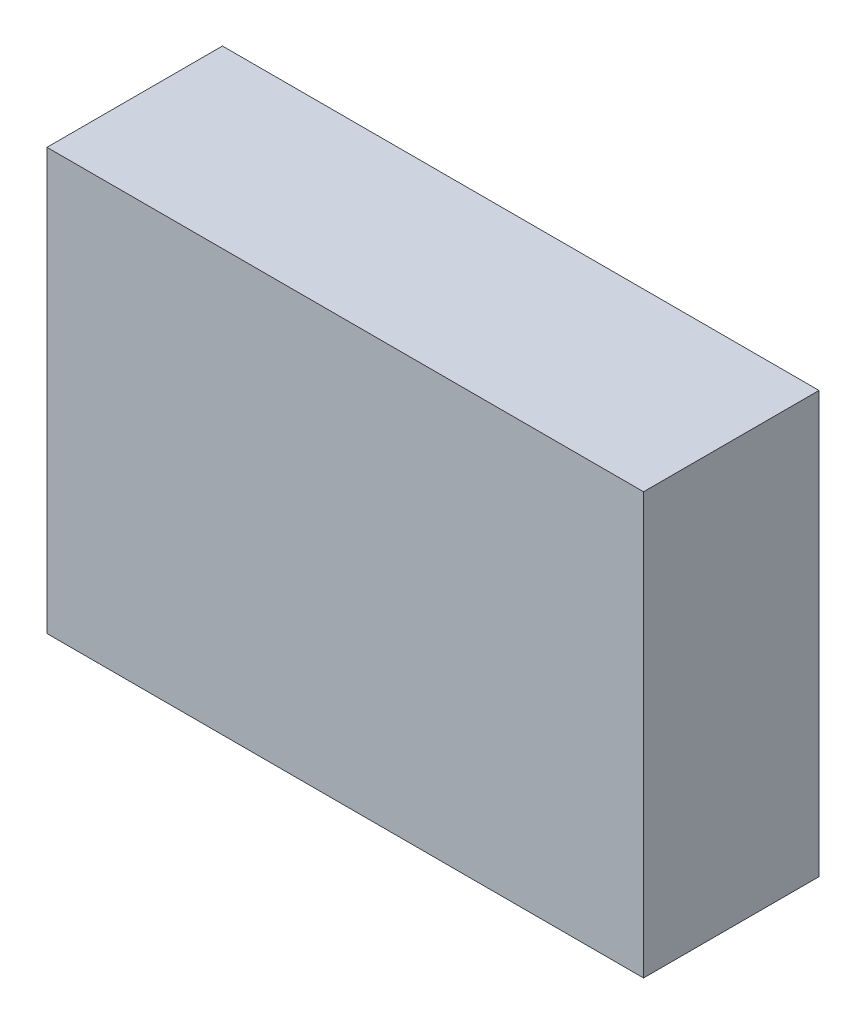
ISO-10303-21;
HEADER;
FILE_DESCRIPTION(('STEP AP214'),'2;1');
FILE_NAME('part.step','',(''),(''),'','','');
FILE_SCHEMA(('AUTOMOTIVE_DESIGN { 1 0 10303 214 1 1 1 1 }'));
ENDSEC;
DATA;
#1=APPLICATION_CONTEXT('core data for automotive mechanical design processes');
#2=APPLICATION_PROTOCOL_DEFINITION('international standard','automotive_design',2000,#1);
#3=PRODUCT_CONTEXT('',#1,'mechanical');
#4=PRODUCT('Part','Part','',(#3));
#5=PRODUCT_RELATED_PRODUCT_CATEGORY('part','',(#4));
#6=PRODUCT_DEFINITION_FORMATION('','',#4);
#7=PRODUCT_DEFINITION_CONTEXT('part definition',#1,'design');
#8=PRODUCT_DEFINITION('design','',#6,#7);
#9=PRODUCT_DEFINITION_SHAPE('','',#8);
#10=(LENGTH_UNIT() NAMED_UNIT(*) SI_UNIT(.MILLI.,.METRE.));
#11=(NAMED_UNIT(*) PLANE_ANGLE_UNIT() SI_UNIT($,.RADIAN.));
#12=(NAMED_UNIT(*) SI_UNIT($,.STERADIAN.) SOLID_ANGLE_UNIT());
#13=UNCERTAINTY_MEASURE_WITH_UNIT(LENGTH_MEASURE(1.E-05),#10,'distance_accuracy_value','');
#14=(GEOMETRIC_REPRESENTATION_CONTEXT(3) GLOBAL_UNCERTAINTY_ASSIGNED_CONTEXT((#13)) GLOBAL_UNIT_ASSIGNED_CONTEXT((#10,
#11,#12)) REPRESENTATION_CONTEXT('',''));
#15=CARTESIAN_POINT('',(0.,0.,0.));
#16=DIRECTION('',(0.,0.,1.));
#17=DIRECTION('',(1.,0.,0.));
#18=AXIS2_PLACEMENT_3D('',#15,#16,#17);
#19=CARTESIAN_POINT('',(2.58,-1.37,0.));
#20=DIRECTION('',(1.,0.,0.));
#21=DIRECTION('',(0.,0.,1.));
#22=AXIS2_PLACEMENT_3D('',#19,#20,#21);
#23=PLANE('',#22);
#24=DIRECTION('',(0.,1.,0.));
#25=VECTOR('',#24,1.);
#26=CARTESIAN_POINT('',(2.58,-1.37,0.1));
#27=LINE('',#26,#25);
#28=CARTESIAN_POINT('',(2.58,-1.37,0.1));
#29=VERTEX_POINT('',#28);
#30=CARTESIAN_POINT('',(2.58,-1.13,0.1));
#31=VERTEX_POINT('',#30);
#32=EDGE_CURVE('E11',#29,#31,#27,.T.);
#33=ORIENTED_EDGE('',*,*,#32,.T.);
#34=DIRECTION('',(0.,0.,1.));
#35=VECTOR('',#34,1.);
#36=CARTESIAN_POINT('',(2.58,-1.13,0.));
#37=LINE('',#36,#35);
#38=CARTESIAN_POINT('',(2.58,-1.13,0.));
#39=VERTEX_POINT('',#38);
#40=EDGE_CURVE('E24',#39,#31,#37,.T.);
#41=ORIENTED_EDGE('',*,*,#40,.F.);
#42=DIRECTION('',(0.,1.,0.));
#43=VECTOR('',#42,1.);
#44=CARTESIAN_POINT('',(2.58,-1.37,0.));
#45=LINE('',#44,#43);
#46=CARTESIAN_POINT('',(2.58,-1.37,0.));
#47=VERTEX_POINT('',#46);
#48=EDGE_CURVE('E86',#47,#39,#45,.T.);
#49=ORIENTED_EDGE('',*,*,#48,.F.);
#50=DIRECTION('',(0.,0.,1.));
#51=VECTOR('',#50,1.);
#52=CARTESIAN_POINT('',(2.58,-1.37,0.));
#53=LINE('',#52,#51);
#54=EDGE_CURVE('E36',#47,#29,#53,.T.);
#55=ORIENTED_EDGE('',*,*,#54,.T.);
#56=EDGE_LOOP('',(#33,#41,#49,#55));
#57=FACE_BOUND('',#56,.T.);
#58=ADVANCED_FACE('F17',(#57),#23,.F.);
#59=CARTESIAN_POINT('',(2.92,-1.37,0.));
#60=DIRECTION('',(1.,0.,0.));
#61=DIRECTION('',(0.,0.,1.));
#62=AXIS2_PLACEMENT_3D('',#59,#60,#61);
#63=PLANE('',#62);
#64=DIRECTION('',(0.,0.,1.));
#65=VECTOR('',#64,1.);
#66=CARTESIAN_POINT('',(2.92,-1.37,0.));
#67=LINE('',#66,#65);
#68=CARTESIAN_POINT('',(2.92,-1.37,0.));
#69=VERTEX_POINT('',#68);
#70=CARTESIAN_POINT('',(2.92,-1.37,0.1));
#71=VERTEX_POINT('',#70);
#72=EDGE_CURVE('E83',#69,#71,#67,.T.);
#73=ORIENTED_EDGE('',*,*,#72,.F.);
#74=DIRECTION('',(0.,1.,0.));
#75=VECTOR('',#74,1.);
#76=CARTESIAN_POINT('',(2.92,-1.37,0.));
#77=LINE('',#76,#75);
#78=CARTESIAN_POINT('',(2.92,-1.13,0.));
#79=VERTEX_POINT('',#78);
#80=EDGE_CURVE('E63',#69,#79,#77,.T.);
#81=ORIENTED_EDGE('',*,*,#80,.T.);
#82=DIRECTION('',(0.,0.,1.));
#83=VECTOR('',#82,1.);
#84=CARTESIAN_POINT('',(2.92,-1.13,0.));
#85=LINE('',#84,#83);
#86=CARTESIAN_POINT('',(2.92,-1.13,0.1));
#87=VERTEX_POINT('',#86);
#88=EDGE_CURVE('E57',#79,#87,#85,.T.);
#89=ORIENTED_EDGE('',*,*,#88,.T.);
#90=DIRECTION('',(0.,1.,0.));
#91=VECTOR('',#90,1.);
#92=CARTESIAN_POINT('',(2.92,-1.37,0.1));
#93=LINE('',#92,#91);
#94=EDGE_CURVE('E60',#71,#87,#93,.T.);
#95=ORIENTED_EDGE('',*,*,#94,.F.);
#96=EDGE_LOOP('',(#73,#81,#89,#95));
#97=FACE_BOUND('',#96,.T.);
#98=ADVANCED_FACE('F59',(#97),#63,.T.);
#99=CARTESIAN_POINT('',(2.58,-1.37,0.));
#100=DIRECTION('',(0.,1.,0.));
#101=DIRECTION('',(0.,0.,1.));
#102=AXIS2_PLACEMENT_3D('',#99,#100,#101);
#103=PLANE('',#102);
#104=ORIENTED_EDGE('',*,*,#72,.T.);
#105=DIRECTION('',(1.,0.,0.));
#106=VECTOR('',#105,1.);
#107=CARTESIAN_POINT('',(2.58,-1.37,0.1));
#108=LINE('',#107,#106);
#109=EDGE_CURVE('E71',#29,#71,#108,.T.);
#110=ORIENTED_EDGE('',*,*,#109,.F.);
#111=ORIENTED_EDGE('',*,*,#54,.F.);
#112=DIRECTION('',(1.,0.,0.));
#113=VECTOR('',#112,1.);
#114=CARTESIAN_POINT('',(2.58,-1.37,0.));
#115=LINE('',#114,#113);
#116=EDGE_CURVE('E76',#47,#69,#115,.T.);
#117=ORIENTED_EDGE('',*,*,#116,.T.);
#118=EDGE_LOOP('',(#104,#110,#111,#117));
#119=FACE_BOUND('',#118,.T.);
#120=ADVANCED_FACE('F91',(#119),#103,.F.);
#121=CARTESIAN_POINT('',(2.58,-1.13,0.));
#122=DIRECTION('',(0.,1.,0.));
#123=DIRECTION('',(0.,0.,1.));
#124=AXIS2_PLACEMENT_3D('',#121,#122,#123);
#125=PLANE('',#124);
#126=DIRECTION('',(1.,0.,0.));
#127=VECTOR('',#126,1.);
#128=CARTESIAN_POINT('',(2.58,-1.13,0.));
#129=LINE('',#128,#127);
#130=EDGE_CURVE('E74',#39,#79,#129,.T.);
#131=ORIENTED_EDGE('',*,*,#130,.F.);
#132=ORIENTED_EDGE('',*,*,#40,.T.);
#133=DIRECTION('',(1.,0.,0.));
#134=VECTOR('',#133,1.);
#135=CARTESIAN_POINT('',(2.58,-1.13,0.1));
#136=LINE('',#135,#134);
#137=EDGE_CURVE('E69',#31,#87,#136,.T.);
#138=ORIENTED_EDGE('',*,*,#137,.T.);
#139=ORIENTED_EDGE('',*,*,#88,.F.);
#140=EDGE_LOOP('',(#131,#132,#138,#139));
#141=FACE_BOUND('',#140,.T.);
#142=ADVANCED_FACE('F73',(#141),#125,.T.);
#143=CARTESIAN_POINT('',(2.58,-1.37,0.));
#144=DIRECTION('',(0.,0.,1.));
#145=DIRECTION('',(1.,0.,0.));
#146=AXIS2_PLACEMENT_3D('',#143,#144,#145);
#147=PLANE('',#146);
#148=ORIENTED_EDGE('',*,*,#130,.T.);
#149=ORIENTED_EDGE('',*,*,#80,.F.);
#150=ORIENTED_EDGE('',*,*,#116,.F.);
#151=ORIENTED_EDGE('',*,*,#48,.T.);
#152=EDGE_LOOP('',(#148,#149,#150,#151));
#153=FACE_BOUND('',#152,.T.);
#154=ADVANCED_FACE('F89',(#153),#147,.F.);
#155=CARTESIAN_POINT('',(2.58,-1.37,0.1));
#156=DIRECTION('',(0.,0.,1.));
#157=DIRECTION('',(1.,0.,0.));
#158=AXIS2_PLACEMENT_3D('',#155,#156,#157);
#159=PLANE('',#158);
#160=ORIENTED_EDGE('',*,*,#32,.F.);
#161=ORIENTED_EDGE('',*,*,#109,.T.);
#162=ORIENTED_EDGE('',*,*,#94,.T.);
#163=ORIENTED_EDGE('',*,*,#137,.F.);
#164=EDGE_LOOP('',(#160,#161,#162,#163));
#165=FACE_BOUND('',#164,.T.);
#166=ADVANCED_FACE('F68',(#165),#159,.T.);
#167=CLOSED_SHELL('',(#58,#98,#120,#142,#154,#166));
#168=MANIFOLD_SOLID_BREP('B1',#167);
#169=ADVANCED_BREP_SHAPE_REPRESENTATION('',(#18,#168),#14);
#170=SHAPE_DEFINITION_REPRESENTATION(#9,#169);
ENDSEC;
END-ISO-10303-21;
